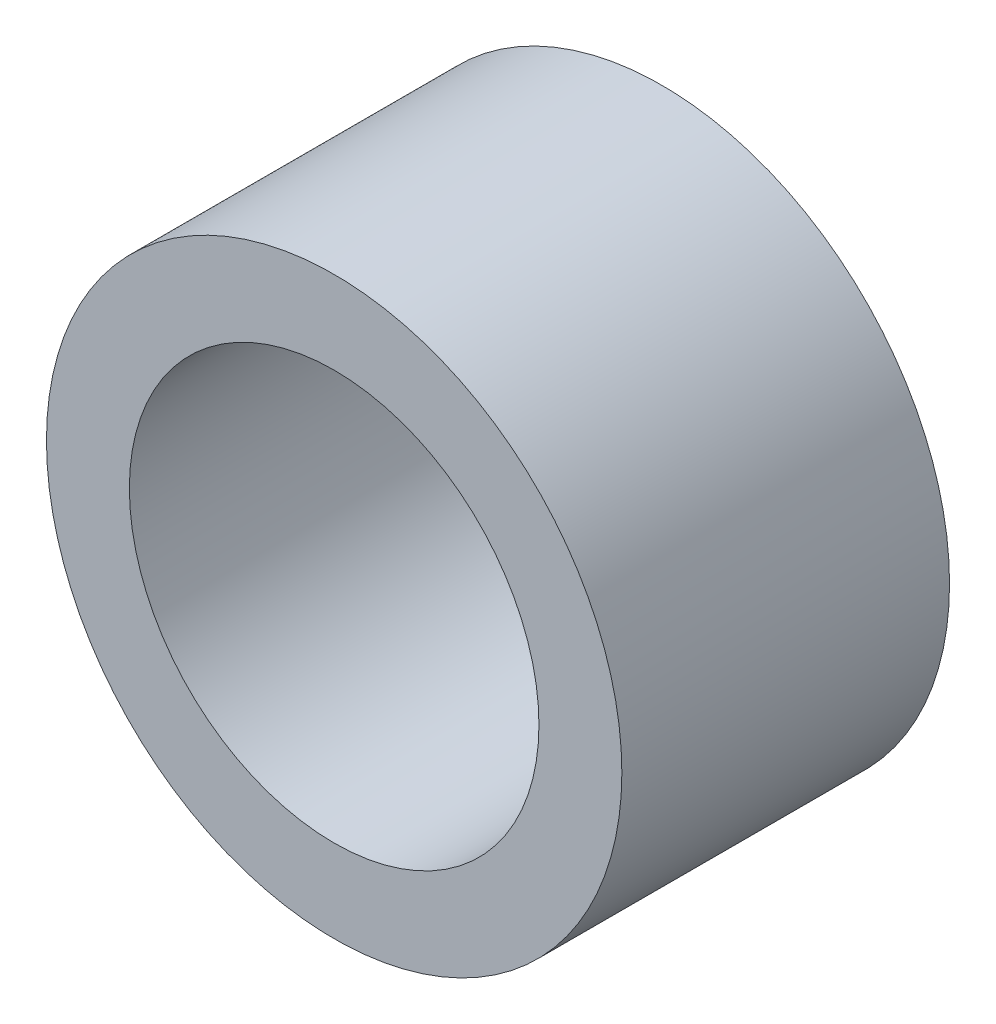
ISO-10303-21;
HEADER;
FILE_DESCRIPTION(('STEP AP214'),'2;1');
FILE_NAME('part.step','',(''),(''),'','','');
FILE_SCHEMA(('AUTOMOTIVE_DESIGN { 1 0 10303 214 1 1 1 1 }'));
ENDSEC;
DATA;
#1=APPLICATION_CONTEXT('core data for automotive mechanical design processes');
#2=APPLICATION_PROTOCOL_DEFINITION('international standard','automotive_design',2000,#1);
#3=PRODUCT_CONTEXT('',#1,'mechanical');
#4=PRODUCT('Part','Part','',(#3));
#5=PRODUCT_RELATED_PRODUCT_CATEGORY('part','',(#4));
#6=PRODUCT_DEFINITION_FORMATION('','',#4);
#7=PRODUCT_DEFINITION_CONTEXT('part definition',#1,'design');
#8=PRODUCT_DEFINITION('design','',#6,#7);
#9=PRODUCT_DEFINITION_SHAPE('','',#8);
#10=(LENGTH_UNIT() NAMED_UNIT(*) SI_UNIT(.MILLI.,.METRE.));
#11=(NAMED_UNIT(*) PLANE_ANGLE_UNIT() SI_UNIT($,.RADIAN.));
#12=(NAMED_UNIT(*) SI_UNIT($,.STERADIAN.) SOLID_ANGLE_UNIT());
#13=UNCERTAINTY_MEASURE_WITH_UNIT(LENGTH_MEASURE(1.E-05),#10,'distance_accuracy_value','');
#14=(GEOMETRIC_REPRESENTATION_CONTEXT(3) GLOBAL_UNCERTAINTY_ASSIGNED_CONTEXT((#13)) GLOBAL_UNIT_ASSIGNED_CONTEXT((#10,
#11,#12)) REPRESENTATION_CONTEXT('',''));
#15=CARTESIAN_POINT('',(0.,0.,0.));
#16=DIRECTION('',(0.,0.,1.));
#17=DIRECTION('',(1.,0.,0.));
#18=AXIS2_PLACEMENT_3D('',#15,#16,#17);
#19=CARTESIAN_POINT('',(0.,0.,3.17499999999998));
#20=DIRECTION('',(0.,0.,1.));
#21=DIRECTION('',(1.,0.,0.));
#22=AXIS2_PLACEMENT_3D('',#19,#20,#21);
#23=PLANE('',#22);
#24=CARTESIAN_POINT('',(0.,0.,3.17499999999998));
#25=DIRECTION('',(0.,0.,1.));
#26=DIRECTION('',(1.,0.,0.));
#27=AXIS2_PLACEMENT_3D('',#24,#25,#26);
#28=CIRCLE('',#27,5.5753);
#29=CARTESIAN_POINT('',(5.57529999999999,0.,3.17499999999998));
#30=VERTEX_POINT('',#29);
#31=EDGE_CURVE('E10',#30,#30,#28,.T.);
#32=ORIENTED_EDGE('',*,*,#31,.T.);
#33=EDGE_LOOP('',(#32));
#34=FACE_BOUND('',#33,.T.);
#35=CARTESIAN_POINT('',(0.,0.,3.17499999999998));
#36=DIRECTION('',(0.,0.,1.));
#37=DIRECTION('',(1.,0.,0.));
#38=AXIS2_PLACEMENT_3D('',#35,#36,#37);
#39=CIRCLE('',#38,3.96875);
#40=CARTESIAN_POINT('',(3.96874999999999,0.,3.17499999999998));
#41=VERTEX_POINT('',#40);
#42=EDGE_CURVE('E39',#41,#41,#39,.T.);
#43=ORIENTED_EDGE('',*,*,#42,.F.);
#44=EDGE_LOOP('',(#43));
#45=FACE_BOUND('',#44,.T.);
#46=ADVANCED_FACE('F28',(#34,#45),#23,.T.);
#47=CARTESIAN_POINT('',(0.,0.,-3.17499999999998));
#48=DIRECTION('',(0.,0.,1.));
#49=DIRECTION('',(1.,0.,0.));
#50=AXIS2_PLACEMENT_3D('',#47,#48,#49);
#51=PLANE('',#50);
#52=CARTESIAN_POINT('',(0.,0.,-3.17499999999998));
#53=DIRECTION('',(0.,0.,1.));
#54=DIRECTION('',(1.,0.,0.));
#55=AXIS2_PLACEMENT_3D('',#52,#53,#54);
#56=CIRCLE('',#55,5.5753);
#57=CARTESIAN_POINT('',(5.5753,0.,-3.17499999999998));
#58=VERTEX_POINT('',#57);
#59=EDGE_CURVE('E32',#58,#58,#56,.T.);
#60=ORIENTED_EDGE('',*,*,#59,.F.);
#61=EDGE_LOOP('',(#60));
#62=FACE_BOUND('',#61,.T.);
#63=CARTESIAN_POINT('',(0.,0.,-3.17499999999998));
#64=DIRECTION('',(0.,0.,1.));
#65=DIRECTION('',(1.,0.,0.));
#66=AXIS2_PLACEMENT_3D('',#63,#64,#65);
#67=CIRCLE('',#66,3.96875);
#68=CARTESIAN_POINT('',(3.96875,0.,-3.17499999999998));
#69=VERTEX_POINT('',#68);
#70=EDGE_CURVE('E41',#69,#69,#67,.T.);
#71=ORIENTED_EDGE('',*,*,#70,.T.);
#72=EDGE_LOOP('',(#71));
#73=FACE_BOUND('',#72,.T.);
#74=ADVANCED_FACE('F51',(#62,#73),#51,.F.);
#75=CARTESIAN_POINT('',(0.,0.,3.17499999999998));
#76=DIRECTION('',(0.,0.,-1.));
#77=DIRECTION('',(-1.,0.,0.));
#78=AXIS2_PLACEMENT_3D('',#75,#76,#77);
#79=CYLINDRICAL_SURFACE('',#78,5.5753);
#80=ORIENTED_EDGE('',*,*,#31,.F.);
#81=EDGE_LOOP('',(#80));
#82=FACE_BOUND('',#81,.T.);
#83=ORIENTED_EDGE('',*,*,#59,.T.);
#84=EDGE_LOOP('',(#83));
#85=FACE_BOUND('',#84,.T.);
#86=ADVANCED_FACE('F30',(#82,#85),#79,.T.);
#87=CARTESIAN_POINT('',(0.,0.,3.17499999999998));
#88=DIRECTION('',(0.,0.,-1.));
#89=DIRECTION('',(-1.,0.,0.));
#90=AXIS2_PLACEMENT_3D('',#87,#88,#89);
#91=CYLINDRICAL_SURFACE('',#90,3.96875);
#92=ORIENTED_EDGE('',*,*,#42,.T.);
#93=EDGE_LOOP('',(#92));
#94=FACE_BOUND('',#93,.T.);
#95=ORIENTED_EDGE('',*,*,#70,.F.);
#96=EDGE_LOOP('',(#95));
#97=FACE_BOUND('',#96,.T.);
#98=ADVANCED_FACE('F47',(#94,#97),#91,.F.);
#99=CLOSED_SHELL('',(#46,#74,#86,#98));
#100=MANIFOLD_SOLID_BREP('B2',#99);
#101=ADVANCED_BREP_SHAPE_REPRESENTATION('',(#18,#100),#14);
#102=SHAPE_DEFINITION_REPRESENTATION(#9,#101);
ENDSEC;
END-ISO-10303-21;
